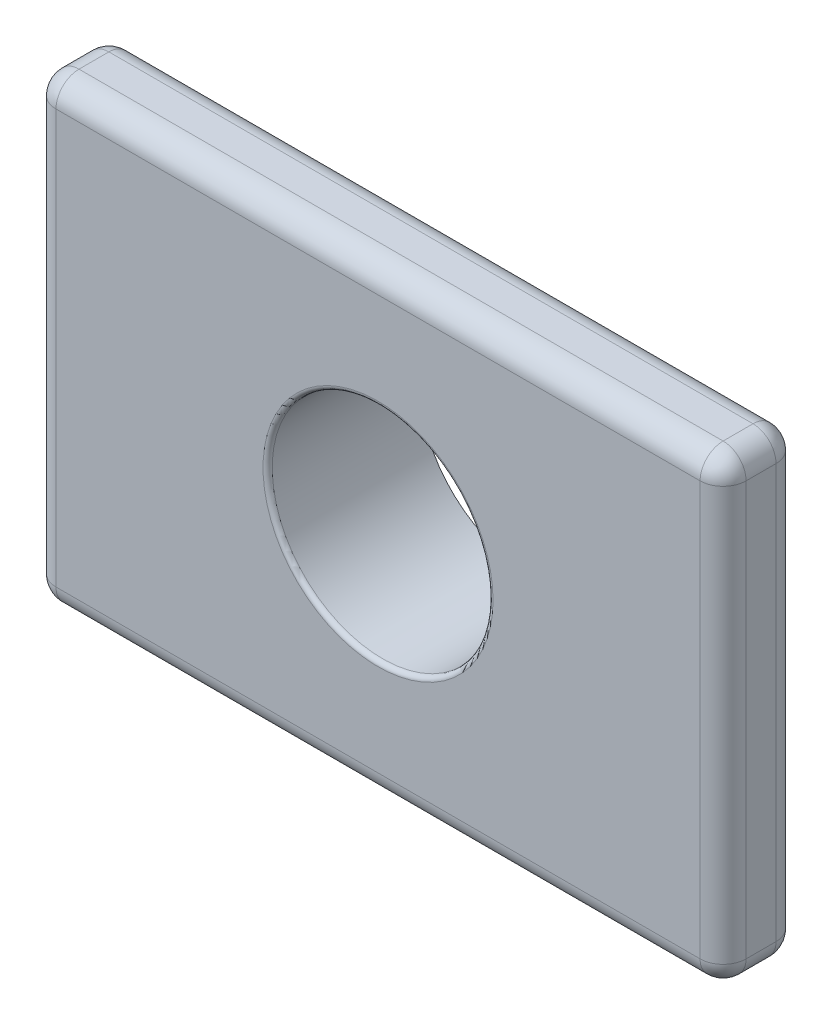
ISO-10303-21;
HEADER;
FILE_DESCRIPTION(('STEP AP214'),'2;1');
FILE_NAME('part.step','',(''),(''),'','','');
FILE_SCHEMA(('AUTOMOTIVE_DESIGN { 1 0 10303 214 1 1 1 1 }'));
ENDSEC;
DATA;
#1=APPLICATION_CONTEXT('core data for automotive mechanical design processes');
#2=APPLICATION_PROTOCOL_DEFINITION('international standard','automotive_design',2000,#1);
#3=PRODUCT_CONTEXT('',#1,'mechanical');
#4=PRODUCT('Part','Part','',(#3));
#5=PRODUCT_RELATED_PRODUCT_CATEGORY('part','',(#4));
#6=PRODUCT_DEFINITION_FORMATION('','',#4);
#7=PRODUCT_DEFINITION_CONTEXT('part definition',#1,'design');
#8=PRODUCT_DEFINITION('design','',#6,#7);
#9=PRODUCT_DEFINITION_SHAPE('','',#8);
#10=(LENGTH_UNIT() NAMED_UNIT(*) SI_UNIT(.MILLI.,.METRE.));
#11=(NAMED_UNIT(*) PLANE_ANGLE_UNIT() SI_UNIT($,.RADIAN.));
#12=(NAMED_UNIT(*) SI_UNIT($,.STERADIAN.) SOLID_ANGLE_UNIT());
#13=UNCERTAINTY_MEASURE_WITH_UNIT(LENGTH_MEASURE(1.E-05),#10,'distance_accuracy_value','');
#14=(GEOMETRIC_REPRESENTATION_CONTEXT(3) GLOBAL_UNCERTAINTY_ASSIGNED_CONTEXT((#13)) GLOBAL_UNIT_ASSIGNED_CONTEXT((#10,
#11,#12)) REPRESENTATION_CONTEXT('',''));
#15=CARTESIAN_POINT('',(0.,0.,0.));
#16=DIRECTION('',(0.,0.,1.));
#17=DIRECTION('',(1.,0.,0.));
#18=AXIS2_PLACEMENT_3D('',#15,#16,#17);
#19=CARTESIAN_POINT('',(0.,0.,0.));
#20=DIRECTION('',(0.,0.,1.));
#21=DIRECTION('',(1.,0.,0.));
#22=AXIS2_PLACEMENT_3D('',#19,#20,#21);
#23=PLANE('',#22);
#24=DIRECTION('',(0.,1.,0.));
#25=VECTOR('',#24,1.);
#26=CARTESIAN_POINT('',(14.5,0.,0.));
#27=LINE('',#26,#25);
#28=CARTESIAN_POINT('',(14.5,9.498,0.));
#29=VERTEX_POINT('',#28);
#30=CARTESIAN_POINT('',(14.5,0.5,0.));
#31=VERTEX_POINT('',#30);
#32=EDGE_CURVE('E313',#29,#31,#27,.F.);
#33=ORIENTED_EDGE('',*,*,#32,.T.);
#34=DIRECTION('',(1.,0.,0.));
#35=VECTOR('',#34,1.);
#36=CARTESIAN_POINT('',(0.,0.5,0.));
#37=LINE('',#36,#35);
#38=CARTESIAN_POINT('',(0.5,0.5,0.));
#39=VERTEX_POINT('',#38);
#40=EDGE_CURVE('E170',#31,#39,#37,.F.);
#41=ORIENTED_EDGE('',*,*,#40,.T.);
#42=DIRECTION('',(0.,1.,0.));
#43=VECTOR('',#42,1.);
#44=CARTESIAN_POINT('',(0.5,9.498,0.));
#45=LINE('',#44,#43);
#46=CARTESIAN_POINT('',(0.5,9.498,0.));
#47=VERTEX_POINT('',#46);
#48=EDGE_CURVE('E64',#39,#47,#45,.T.);
#49=ORIENTED_EDGE('',*,*,#48,.T.);
#50=DIRECTION('',(1.,0.,0.));
#51=VECTOR('',#50,1.);
#52=CARTESIAN_POINT('',(14.5,9.498,0.));
#53=LINE('',#52,#51);
#54=EDGE_CURVE('E316',#47,#29,#53,.T.);
#55=ORIENTED_EDGE('',*,*,#54,.T.);
#56=EDGE_LOOP('',(#33,#41,#49,#55));
#57=FACE_BOUND('',#56,.T.);
#58=CARTESIAN_POINT('',(7.5,4.999,0.));
#59=DIRECTION('',(0.,0.,1.));
#60=DIRECTION('',(1.,0.,0.));
#61=AXIS2_PLACEMENT_3D('',#58,#59,#60);
#62=CIRCLE('',#61,2.7);
#63=CARTESIAN_POINT('',(10.2,4.999,0.));
#64=VERTEX_POINT('',#63);
#65=EDGE_CURVE('E257',#64,#64,#62,.T.);
#66=ORIENTED_EDGE('',*,*,#65,.T.);
#67=EDGE_LOOP('',(#66));
#68=FACE_BOUND('',#67,.T.);
#69=ADVANCED_FACE('F38',(#57,#68),#23,.F.);
#70=CARTESIAN_POINT('',(0.,0.,1.65));
#71=DIRECTION('',(0.,1.,0.));
#72=DIRECTION('',(0.,0.,1.));
#73=AXIS2_PLACEMENT_3D('',#70,#71,#72);
#74=PLANE('',#73);
#75=DIRECTION('',(0.,0.,-1.));
#76=VECTOR('',#75,1.);
#77=CARTESIAN_POINT('',(14.5,0.,1.65));
#78=LINE('',#77,#76);
#79=CARTESIAN_POINT('',(14.5,0.,0.5));
#80=VERTEX_POINT('',#79);
#81=CARTESIAN_POINT('',(14.5,0.,1.15));
#82=VERTEX_POINT('',#81);
#83=EDGE_CURVE('E141',#80,#82,#78,.F.);
#84=ORIENTED_EDGE('',*,*,#83,.T.);
#85=DIRECTION('',(1.,0.,0.));
#86=VECTOR('',#85,1.);
#87=CARTESIAN_POINT('',(0.5,0.,1.15));
#88=LINE('',#87,#86);
#89=CARTESIAN_POINT('',(0.5,0.,1.15));
#90=VERTEX_POINT('',#89);
#91=EDGE_CURVE('E145',#82,#90,#88,.F.);
#92=ORIENTED_EDGE('',*,*,#91,.T.);
#93=DIRECTION('',(0.,0.,-1.));
#94=VECTOR('',#93,1.);
#95=CARTESIAN_POINT('',(0.5,0.,0.));
#96=LINE('',#95,#94);
#97=CARTESIAN_POINT('',(0.5,0.,0.5));
#98=VERTEX_POINT('',#97);
#99=EDGE_CURVE('E143',#90,#98,#96,.T.);
#100=ORIENTED_EDGE('',*,*,#99,.T.);
#101=DIRECTION('',(1.,0.,0.));
#102=VECTOR('',#101,1.);
#103=CARTESIAN_POINT('',(0.,0.,0.5));
#104=LINE('',#103,#102);
#105=EDGE_CURVE('E138',#98,#80,#104,.T.);
#106=ORIENTED_EDGE('',*,*,#105,.T.);
#107=EDGE_LOOP('',(#84,#92,#100,#106));
#108=FACE_BOUND('',#107,.T.);
#109=ADVANCED_FACE('F140',(#108),#74,.F.);
#110=CARTESIAN_POINT('',(15.,0.,1.65));
#111=DIRECTION('',(-1.,0.,0.));
#112=DIRECTION('',(0.,0.,1.));
#113=AXIS2_PLACEMENT_3D('',#110,#111,#112);
#114=PLANE('',#113);
#115=DIRECTION('',(0.,0.,-1.));
#116=VECTOR('',#115,1.);
#117=CARTESIAN_POINT('',(15.,9.498,1.65));
#118=LINE('',#117,#116);
#119=CARTESIAN_POINT('',(15.,9.498,0.5));
#120=VERTEX_POINT('',#119);
#121=CARTESIAN_POINT('',(15.,9.498,1.15));
#122=VERTEX_POINT('',#121);
#123=EDGE_CURVE('E270',#120,#122,#118,.F.);
#124=ORIENTED_EDGE('',*,*,#123,.T.);
#125=DIRECTION('',(0.,1.,0.));
#126=VECTOR('',#125,1.);
#127=CARTESIAN_POINT('',(15.,0.5,1.15));
#128=LINE('',#127,#126);
#129=CARTESIAN_POINT('',(15.,0.5,1.15));
#130=VERTEX_POINT('',#129);
#131=EDGE_CURVE('E11',#122,#130,#128,.F.);
#132=ORIENTED_EDGE('',*,*,#131,.T.);
#133=DIRECTION('',(0.,0.,-1.));
#134=VECTOR('',#133,1.);
#135=CARTESIAN_POINT('',(15.,0.5,1.65));
#136=LINE('',#135,#134);
#137=CARTESIAN_POINT('',(15.,0.5,0.5));
#138=VERTEX_POINT('',#137);
#139=EDGE_CURVE('E268',#130,#138,#136,.T.);
#140=ORIENTED_EDGE('',*,*,#139,.T.);
#141=DIRECTION('',(0.,1.,0.));
#142=VECTOR('',#141,1.);
#143=CARTESIAN_POINT('',(15.,0.,0.5));
#144=LINE('',#143,#142);
#145=EDGE_CURVE('E48',#138,#120,#144,.T.);
#146=ORIENTED_EDGE('',*,*,#145,.T.);
#147=EDGE_LOOP('',(#124,#132,#140,#146));
#148=FACE_BOUND('',#147,.T.);
#149=ADVANCED_FACE('F322',(#148),#114,.F.);
#150=CARTESIAN_POINT('',(0.,9.998,1.65));
#151=DIRECTION('',(0.,1.,0.));
#152=DIRECTION('',(0.,0.,1.));
#153=AXIS2_PLACEMENT_3D('',#150,#151,#152);
#154=PLANE('',#153);
#155=DIRECTION('',(0.,0.,-1.));
#156=VECTOR('',#155,1.);
#157=CARTESIAN_POINT('',(0.5,9.998,1.65));
#158=LINE('',#157,#156);
#159=CARTESIAN_POINT('',(0.5,9.998,0.5));
#160=VERTEX_POINT('',#159);
#161=CARTESIAN_POINT('',(0.5,9.998,1.15));
#162=VERTEX_POINT('',#161);
#163=EDGE_CURVE('E261',#160,#162,#158,.F.);
#164=ORIENTED_EDGE('',*,*,#163,.T.);
#165=DIRECTION('',(1.,0.,0.));
#166=VECTOR('',#165,1.);
#167=CARTESIAN_POINT('',(0.,9.998,1.15));
#168=LINE('',#167,#166);
#169=CARTESIAN_POINT('',(14.5,9.998,1.15));
#170=VERTEX_POINT('',#169);
#171=EDGE_CURVE('E304',#162,#170,#168,.T.);
#172=ORIENTED_EDGE('',*,*,#171,.T.);
#173=DIRECTION('',(0.,0.,-1.));
#174=VECTOR('',#173,1.);
#175=CARTESIAN_POINT('',(14.5,9.998,0.));
#176=LINE('',#175,#174);
#177=CARTESIAN_POINT('',(14.5,9.998,0.5));
#178=VERTEX_POINT('',#177);
#179=EDGE_CURVE('E264',#170,#178,#176,.T.);
#180=ORIENTED_EDGE('',*,*,#179,.T.);
#181=DIRECTION('',(1.,0.,0.));
#182=VECTOR('',#181,1.);
#183=CARTESIAN_POINT('',(0.5,9.998,0.5));
#184=LINE('',#183,#182);
#185=EDGE_CURVE('E301',#178,#160,#184,.F.);
#186=ORIENTED_EDGE('',*,*,#185,.T.);
#187=EDGE_LOOP('',(#164,#172,#180,#186));
#188=FACE_BOUND('',#187,.T.);
#189=ADVANCED_FACE('F340',(#188),#154,.T.);
#190=CARTESIAN_POINT('',(0.,0.,1.65));
#191=DIRECTION('',(-1.,0.,0.));
#192=DIRECTION('',(0.,0.,1.));
#193=AXIS2_PLACEMENT_3D('',#190,#191,#192);
#194=PLANE('',#193);
#195=DIRECTION('',(0.,0.,-1.));
#196=VECTOR('',#195,1.);
#197=CARTESIAN_POINT('',(0.,0.5,1.65));
#198=LINE('',#197,#196);
#199=CARTESIAN_POINT('',(0.,0.5,0.5));
#200=VERTEX_POINT('',#199);
#201=CARTESIAN_POINT('',(0.,0.5,1.15));
#202=VERTEX_POINT('',#201);
#203=EDGE_CURVE('E158',#200,#202,#198,.F.);
#204=ORIENTED_EDGE('',*,*,#203,.T.);
#205=DIRECTION('',(0.,1.,0.));
#206=VECTOR('',#205,1.);
#207=CARTESIAN_POINT('',(0.,0.,1.15));
#208=LINE('',#207,#206);
#209=CARTESIAN_POINT('',(0.,9.498,1.15));
#210=VERTEX_POINT('',#209);
#211=EDGE_CURVE('E295',#202,#210,#208,.T.);
#212=ORIENTED_EDGE('',*,*,#211,.T.);
#213=DIRECTION('',(0.,0.,-1.));
#214=VECTOR('',#213,1.);
#215=CARTESIAN_POINT('',(0.,9.498,1.65));
#216=LINE('',#215,#214);
#217=CARTESIAN_POINT('',(0.,9.498,0.5));
#218=VERTEX_POINT('',#217);
#219=EDGE_CURVE('E167',#210,#218,#216,.T.);
#220=ORIENTED_EDGE('',*,*,#219,.T.);
#221=DIRECTION('',(0.,1.,0.));
#222=VECTOR('',#221,1.);
#223=CARTESIAN_POINT('',(0.,0.5,0.5));
#224=LINE('',#223,#222);
#225=EDGE_CURVE('E293',#218,#200,#224,.F.);
#226=ORIENTED_EDGE('',*,*,#225,.T.);
#227=EDGE_LOOP('',(#204,#212,#220,#226));
#228=FACE_BOUND('',#227,.T.);
#229=ADVANCED_FACE('F352',(#228),#194,.T.);
#230=CARTESIAN_POINT('',(0.,0.,1.65));
#231=DIRECTION('',(0.,0.,1.));
#232=DIRECTION('',(1.,0.,0.));
#233=AXIS2_PLACEMENT_3D('',#230,#231,#232);
#234=PLANE('',#233);
#235=DIRECTION('',(0.,1.,0.));
#236=VECTOR('',#235,1.);
#237=CARTESIAN_POINT('',(0.5,0.,1.65));
#238=LINE('',#237,#236);
#239=CARTESIAN_POINT('',(0.5,9.498,1.65));
#240=VERTEX_POINT('',#239);
#241=CARTESIAN_POINT('',(0.5,0.5,1.65));
#242=VERTEX_POINT('',#241);
#243=EDGE_CURVE('E284',#240,#242,#238,.F.);
#244=ORIENTED_EDGE('',*,*,#243,.T.);
#245=DIRECTION('',(1.,0.,0.));
#246=VECTOR('',#245,1.);
#247=CARTESIAN_POINT('',(14.5,0.5,1.65));
#248=LINE('',#247,#246);
#249=CARTESIAN_POINT('',(14.5,0.5,1.65));
#250=VERTEX_POINT('',#249);
#251=EDGE_CURVE('E146',#242,#250,#248,.T.);
#252=ORIENTED_EDGE('',*,*,#251,.T.);
#253=DIRECTION('',(0.,1.,0.));
#254=VECTOR('',#253,1.);
#255=CARTESIAN_POINT('',(14.5,9.498,1.65));
#256=LINE('',#255,#254);
#257=CARTESIAN_POINT('',(14.5,9.498,1.65));
#258=VERTEX_POINT('',#257);
#259=EDGE_CURVE('E279',#250,#258,#256,.T.);
#260=ORIENTED_EDGE('',*,*,#259,.T.);
#261=DIRECTION('',(1.,0.,0.));
#262=VECTOR('',#261,1.);
#263=CARTESIAN_POINT('',(0.,9.498,1.65));
#264=LINE('',#263,#262);
#265=EDGE_CURVE('E282',#258,#240,#264,.F.);
#266=ORIENTED_EDGE('',*,*,#265,.T.);
#267=EDGE_LOOP('',(#244,#252,#260,#266));
#268=FACE_BOUND('',#267,.T.);
#269=CARTESIAN_POINT('',(7.5,4.999,1.65));
#270=DIRECTION('',(0.,0.,1.));
#271=DIRECTION('',(1.,0.,0.));
#272=AXIS2_PLACEMENT_3D('',#269,#270,#271);
#273=CIRCLE('',#272,2.5);
#274=CARTESIAN_POINT('',(10.,4.999,1.65));
#275=VERTEX_POINT('',#274);
#276=EDGE_CURVE('E241',#275,#275,#273,.F.);
#277=ORIENTED_EDGE('',*,*,#276,.T.);
#278=EDGE_LOOP('',(#277));
#279=FACE_BOUND('',#278,.T.);
#280=ADVANCED_FACE('F366',(#268,#279),#234,.T.);
#281=CARTESIAN_POINT('',(7.5,4.999,-1.65));
#282=DIRECTION('',(0.,0.,1.));
#283=DIRECTION('',(1.,0.,0.));
#284=AXIS2_PLACEMENT_3D('',#281,#282,#283);
#285=CYLINDRICAL_SURFACE('',#284,2.6);
#286=CARTESIAN_POINT('',(7.5,4.999,-1.55));
#287=DIRECTION('',(0.,0.,-1.));
#288=DIRECTION('',(-1.,0.,0.));
#289=AXIS2_PLACEMENT_3D('',#286,#287,#288);
#290=CIRCLE('',#289,2.6);
#291=CARTESIAN_POINT('',(4.9,4.999,-1.55));
#292=VERTEX_POINT('',#291);
#293=EDGE_CURVE('E254',#292,#292,#290,.F.);
#294=ORIENTED_EDGE('',*,*,#293,.T.);
#295=EDGE_LOOP('',(#294));
#296=FACE_BOUND('',#295,.T.);
#297=CARTESIAN_POINT('',(7.5,4.999,-0.1));
#298=DIRECTION('',(0.,0.,1.));
#299=DIRECTION('',(1.,0.,0.));
#300=AXIS2_PLACEMENT_3D('',#297,#298,#299);
#301=CIRCLE('',#300,2.6);
#302=CARTESIAN_POINT('',(10.1,4.999,-0.1));
#303=VERTEX_POINT('',#302);
#304=EDGE_CURVE('E250',#303,#303,#301,.F.);
#305=ORIENTED_EDGE('',*,*,#304,.T.);
#306=EDGE_LOOP('',(#305));
#307=FACE_BOUND('',#306,.T.);
#308=ADVANCED_FACE('F604',(#296,#307),#285,.T.);
#309=CARTESIAN_POINT('',(7.5,4.999,-1.65));
#310=DIRECTION('',(0.,0.,-1.));
#311=DIRECTION('',(-1.,0.,0.));
#312=AXIS2_PLACEMENT_3D('',#309,#310,#311);
#313=PLANE('',#312);
#314=CARTESIAN_POINT('',(7.5,4.999,-1.65));
#315=DIRECTION('',(0.,0.,-1.));
#316=DIRECTION('',(-1.,0.,0.));
#317=AXIS2_PLACEMENT_3D('',#314,#315,#316);
#318=CIRCLE('',#317,2.5);
#319=CARTESIAN_POINT('',(5.,4.999,-1.65));
#320=VERTEX_POINT('',#319);
#321=EDGE_CURVE('E247',#320,#320,#318,.T.);
#322=ORIENTED_EDGE('',*,*,#321,.T.);
#323=EDGE_LOOP('',(#322));
#324=FACE_BOUND('',#323,.T.);
#325=CARTESIAN_POINT('',(7.5,4.999,-1.65));
#326=DIRECTION('',(0.,0.,1.));
#327=DIRECTION('',(1.,0.,0.));
#328=AXIS2_PLACEMENT_3D('',#325,#326,#327);
#329=CIRCLE('',#328,2.4);
#330=CARTESIAN_POINT('',(9.9,4.999,-1.65));
#331=VERTEX_POINT('',#330);
#332=EDGE_CURVE('E229',#331,#331,#329,.T.);
#333=ORIENTED_EDGE('',*,*,#332,.T.);
#334=EDGE_LOOP('',(#333));
#335=FACE_BOUND('',#334,.T.);
#336=ADVANCED_FACE('F595',(#324,#335),#313,.T.);
#337=CARTESIAN_POINT('',(7.5,4.999,-1.65));
#338=DIRECTION('',(0.,0.,1.));
#339=DIRECTION('',(1.,0.,0.));
#340=AXIS2_PLACEMENT_3D('',#337,#338,#339);
#341=CYLINDRICAL_SURFACE('',#340,2.4);
#342=CARTESIAN_POINT('',(7.5,4.999,1.55));
#343=DIRECTION('',(0.,0.,1.));
#344=DIRECTION('',(1.,0.,0.));
#345=AXIS2_PLACEMENT_3D('',#342,#343,#344);
#346=CIRCLE('',#345,2.4);
#347=CARTESIAN_POINT('',(9.9,4.999,1.55));
#348=VERTEX_POINT('',#347);
#349=EDGE_CURVE('E235',#348,#348,#346,.T.);
#350=ORIENTED_EDGE('',*,*,#349,.T.);
#351=EDGE_LOOP('',(#350));
#352=FACE_BOUND('',#351,.T.);
#353=ORIENTED_EDGE('',*,*,#332,.F.);
#354=EDGE_LOOP('',(#353));
#355=FACE_BOUND('',#354,.T.);
#356=ADVANCED_FACE('F406',(#352,#355),#341,.F.);
#357=CARTESIAN_POINT('',(7.5,4.999,1.55));
#358=DIRECTION('',(0.,0.,1.));
#359=DIRECTION('',(1.,0.,0.));
#360=AXIS2_PLACEMENT_3D('',#357,#358,#359);
#361=TOROIDAL_SURFACE('',#360,2.5,0.1);
#362=ORIENTED_EDGE('',*,*,#276,.F.);
#363=EDGE_LOOP('',(#362));
#364=FACE_BOUND('',#363,.T.);
#365=ORIENTED_EDGE('',*,*,#349,.F.);
#366=EDGE_LOOP('',(#365));
#367=FACE_BOUND('',#366,.T.);
#368=ADVANCED_FACE('F402',(#364,#367),#361,.T.);
#369=CARTESIAN_POINT('',(7.5,4.999,-1.55));
#370=DIRECTION('',(0.,0.,-1.));
#371=DIRECTION('',(-1.,0.,0.));
#372=AXIS2_PLACEMENT_3D('',#369,#370,#371);
#373=TOROIDAL_SURFACE('',#372,2.5,0.1);
#374=ORIENTED_EDGE('',*,*,#293,.F.);
#375=EDGE_LOOP('',(#374));
#376=FACE_BOUND('',#375,.T.);
#377=ORIENTED_EDGE('',*,*,#321,.F.);
#378=EDGE_LOOP('',(#377));
#379=FACE_BOUND('',#378,.T.);
#380=ADVANCED_FACE('F405',(#376,#379),#373,.T.);
#381=CARTESIAN_POINT('',(7.5,4.999,-0.1));
#382=DIRECTION('',(0.,0.,1.));
#383=DIRECTION('',(1.,0.,0.));
#384=AXIS2_PLACEMENT_3D('',#381,#382,#383);
#385=TOROIDAL_SURFACE('',#384,2.7,0.1);
#386=ORIENTED_EDGE('',*,*,#65,.F.);
#387=EDGE_LOOP('',(#386));
#388=FACE_BOUND('',#387,.T.);
#389=ORIENTED_EDGE('',*,*,#304,.F.);
#390=EDGE_LOOP('',(#389));
#391=FACE_BOUND('',#390,.T.);
#392=ADVANCED_FACE('F410',(#388,#391),#385,.F.);
#393=CARTESIAN_POINT('',(14.5,9.498,1.65));
#394=DIRECTION('',(0.,0.,1.));
#395=DIRECTION('',(1.,0.,0.));
#396=AXIS2_PLACEMENT_3D('',#393,#394,#395);
#397=CYLINDRICAL_SURFACE('',#396,0.5);
#398=ORIENTED_EDGE('',*,*,#179,.F.);
#399=CARTESIAN_POINT('',(14.5,9.498,1.15));
#400=DIRECTION('',(0.,0.,1.));
#401=DIRECTION('',(1.,0.,0.));
#402=AXIS2_PLACEMENT_3D('',#399,#400,#401);
#403=CIRCLE('',#402,0.5);
#404=EDGE_CURVE('E310',#170,#122,#403,.F.);
#405=ORIENTED_EDGE('',*,*,#404,.T.);
#406=ORIENTED_EDGE('',*,*,#123,.F.);
#407=CARTESIAN_POINT('',(14.5,9.498,0.5));
#408=DIRECTION('',(0.,0.,1.));
#409=DIRECTION('',(1.,0.,0.));
#410=AXIS2_PLACEMENT_3D('',#407,#408,#409);
#411=CIRCLE('',#410,0.5);
#412=EDGE_CURVE('E307',#120,#178,#411,.T.);
#413=ORIENTED_EDGE('',*,*,#412,.T.);
#414=EDGE_LOOP('',(#398,#405,#406,#413));
#415=FACE_BOUND('',#414,.T.);
#416=ADVANCED_FACE('F328',(#415),#397,.T.);
#417=CARTESIAN_POINT('',(14.5,0.5,1.65));
#418=DIRECTION('',(0.,0.,-1.));
#419=DIRECTION('',(-1.,0.,0.));
#420=AXIS2_PLACEMENT_3D('',#417,#418,#419);
#421=CYLINDRICAL_SURFACE('',#420,0.5);
#422=ORIENTED_EDGE('',*,*,#139,.F.);
#423=CARTESIAN_POINT('',(14.5,0.5,1.15));
#424=DIRECTION('',(0.,0.,-1.));
#425=DIRECTION('',(-1.,0.,0.));
#426=AXIS2_PLACEMENT_3D('',#423,#424,#425);
#427=CIRCLE('',#426,0.5);
#428=EDGE_CURVE('E157',#130,#82,#427,.T.);
#429=ORIENTED_EDGE('',*,*,#428,.T.);
#430=ORIENTED_EDGE('',*,*,#83,.F.);
#431=CARTESIAN_POINT('',(14.5,0.5,0.5));
#432=DIRECTION('',(0.,0.,-1.));
#433=DIRECTION('',(-1.,0.,0.));
#434=AXIS2_PLACEMENT_3D('',#431,#432,#433);
#435=CIRCLE('',#434,0.5);
#436=EDGE_CURVE('E154',#80,#138,#435,.F.);
#437=ORIENTED_EDGE('',*,*,#436,.T.);
#438=EDGE_LOOP('',(#422,#429,#430,#437));
#439=FACE_BOUND('',#438,.T.);
#440=ADVANCED_FACE('F153',(#439),#421,.T.);
#441=CARTESIAN_POINT('',(0.5,9.498,1.65));
#442=DIRECTION('',(0.,0.,-1.));
#443=DIRECTION('',(-1.,0.,0.));
#444=AXIS2_PLACEMENT_3D('',#441,#442,#443);
#445=CYLINDRICAL_SURFACE('',#444,0.5);
#446=ORIENTED_EDGE('',*,*,#219,.F.);
#447=CARTESIAN_POINT('',(0.5,9.498,1.15));
#448=DIRECTION('',(0.,0.,-1.));
#449=DIRECTION('',(-1.,0.,0.));
#450=AXIS2_PLACEMENT_3D('',#447,#448,#449);
#451=CIRCLE('',#450,0.5);
#452=EDGE_CURVE('E299',#210,#162,#451,.T.);
#453=ORIENTED_EDGE('',*,*,#452,.T.);
#454=ORIENTED_EDGE('',*,*,#163,.F.);
#455=CARTESIAN_POINT('',(0.5,9.498,0.5));
#456=DIRECTION('',(0.,0.,-1.));
#457=DIRECTION('',(-1.,0.,0.));
#458=AXIS2_PLACEMENT_3D('',#455,#456,#457);
#459=CIRCLE('',#458,0.5);
#460=EDGE_CURVE('E297',#160,#218,#459,.F.);
#461=ORIENTED_EDGE('',*,*,#460,.T.);
#462=EDGE_LOOP('',(#446,#453,#454,#461));
#463=FACE_BOUND('',#462,.T.);
#464=ADVANCED_FACE('F344',(#463),#445,.T.);
#465=CARTESIAN_POINT('',(0.5,0.5,1.65));
#466=DIRECTION('',(0.,0.,1.));
#467=DIRECTION('',(1.,0.,0.));
#468=AXIS2_PLACEMENT_3D('',#465,#466,#467);
#469=CYLINDRICAL_SURFACE('',#468,0.5);
#470=ORIENTED_EDGE('',*,*,#99,.F.);
#471=CARTESIAN_POINT('',(0.5,0.5,1.15));
#472=DIRECTION('',(0.,0.,1.));
#473=DIRECTION('',(1.,0.,0.));
#474=AXIS2_PLACEMENT_3D('',#471,#472,#473);
#475=CIRCLE('',#474,0.5);
#476=EDGE_CURVE('E291',#90,#202,#475,.F.);
#477=ORIENTED_EDGE('',*,*,#476,.T.);
#478=ORIENTED_EDGE('',*,*,#203,.F.);
#479=CARTESIAN_POINT('',(0.5,0.5,0.5));
#480=DIRECTION('',(0.,0.,1.));
#481=DIRECTION('',(1.,0.,0.));
#482=AXIS2_PLACEMENT_3D('',#479,#480,#481);
#483=CIRCLE('',#482,0.5);
#484=EDGE_CURVE('E289',#200,#98,#483,.T.);
#485=ORIENTED_EDGE('',*,*,#484,.T.);
#486=EDGE_LOOP('',(#470,#477,#478,#485));
#487=FACE_BOUND('',#486,.T.);
#488=ADVANCED_FACE('F354',(#487),#469,.T.);
#489=CARTESIAN_POINT('',(0.5,9.498,1.15));
#490=DIRECTION('',(0.,0.,1.));
#491=DIRECTION('',(1.,0.,0.));
#492=AXIS2_PLACEMENT_3D('',#489,#490,#491);
#493=SPHERICAL_SURFACE('',#492,0.5);
#494=CARTESIAN_POINT('',(0.5,9.498,1.15));
#495=DIRECTION('',(1.,0.,0.));
#496=DIRECTION('',(0.,0.,-1.));
#497=AXIS2_PLACEMENT_3D('',#494,#495,#496);
#498=CIRCLE('',#497,0.5);
#499=EDGE_CURVE('E218',#162,#240,#498,.T.);
#500=ORIENTED_EDGE('',*,*,#499,.F.);
#501=ORIENTED_EDGE('',*,*,#452,.F.);
#502=CARTESIAN_POINT('',(0.5,9.498,1.15));
#503=DIRECTION('',(0.,-1.,0.));
#504=DIRECTION('',(0.,0.,-1.));
#505=AXIS2_PLACEMENT_3D('',#502,#503,#504);
#506=CIRCLE('',#505,0.5);
#507=EDGE_CURVE('E174',#240,#210,#506,.T.);
#508=ORIENTED_EDGE('',*,*,#507,.F.);
#509=EDGE_LOOP('',(#500,#501,#508));
#510=FACE_BOUND('',#509,.T.);
#511=ADVANCED_FACE('F370',(#510),#493,.T.);
#512=CARTESIAN_POINT('',(0.5,0.,1.15));
#513=DIRECTION('',(0.,1.,0.));
#514=DIRECTION('',(0.,0.,1.));
#515=AXIS2_PLACEMENT_3D('',#512,#513,#514);
#516=CYLINDRICAL_SURFACE('',#515,0.5);
#517=ORIENTED_EDGE('',*,*,#507,.T.);
#518=ORIENTED_EDGE('',*,*,#211,.F.);
#519=CARTESIAN_POINT('',(0.5,0.5,1.15));
#520=DIRECTION('',(0.,-1.,0.));
#521=DIRECTION('',(0.,0.,-1.));
#522=AXIS2_PLACEMENT_3D('',#519,#520,#521);
#523=CIRCLE('',#522,0.5);
#524=EDGE_CURVE('E216',#242,#202,#523,.T.);
#525=ORIENTED_EDGE('',*,*,#524,.F.);
#526=ORIENTED_EDGE('',*,*,#243,.F.);
#527=EDGE_LOOP('',(#517,#518,#525,#526));
#528=FACE_BOUND('',#527,.T.);
#529=ADVANCED_FACE('F368',(#528),#516,.T.);
#530=CARTESIAN_POINT('',(0.,9.498,1.15));
#531=DIRECTION('',(1.,0.,0.));
#532=DIRECTION('',(0.,0.,-1.));
#533=AXIS2_PLACEMENT_3D('',#530,#531,#532);
#534=CYLINDRICAL_SURFACE('',#533,0.5);
#535=ORIENTED_EDGE('',*,*,#499,.T.);
#536=ORIENTED_EDGE('',*,*,#265,.F.);
#537=CARTESIAN_POINT('',(14.5,9.498,1.15));
#538=DIRECTION('',(1.,0.,0.));
#539=DIRECTION('',(0.,0.,-1.));
#540=AXIS2_PLACEMENT_3D('',#537,#538,#539);
#541=CIRCLE('',#540,0.5);
#542=EDGE_CURVE('E212',#170,#258,#541,.T.);
#543=ORIENTED_EDGE('',*,*,#542,.F.);
#544=ORIENTED_EDGE('',*,*,#171,.F.);
#545=EDGE_LOOP('',(#535,#536,#543,#544));
#546=FACE_BOUND('',#545,.T.);
#547=ADVANCED_FACE('F372',(#546),#534,.T.);
#548=CARTESIAN_POINT('',(0.5,0.5,1.15));
#549=DIRECTION('',(0.,0.,1.));
#550=DIRECTION('',(1.,0.,0.));
#551=AXIS2_PLACEMENT_3D('',#548,#549,#550);
#552=SPHERICAL_SURFACE('',#551,0.5);
#553=ORIENTED_EDGE('',*,*,#524,.T.);
#554=ORIENTED_EDGE('',*,*,#476,.F.);
#555=CARTESIAN_POINT('',(0.5,0.5,1.15));
#556=DIRECTION('',(1.,0.,0.));
#557=DIRECTION('',(0.,0.,-1.));
#558=AXIS2_PLACEMENT_3D('',#555,#556,#557);
#559=CIRCLE('',#558,0.5);
#560=EDGE_CURVE('E209',#242,#90,#559,.T.);
#561=ORIENTED_EDGE('',*,*,#560,.F.);
#562=EDGE_LOOP('',(#553,#554,#561));
#563=FACE_BOUND('',#562,.T.);
#564=ADVANCED_FACE('F358',(#563),#552,.T.);
#565=CARTESIAN_POINT('',(14.5,9.498,1.15));
#566=DIRECTION('',(0.,0.,1.));
#567=DIRECTION('',(1.,0.,0.));
#568=AXIS2_PLACEMENT_3D('',#565,#566,#567);
#569=SPHERICAL_SURFACE('',#568,0.5);
#570=ORIENTED_EDGE('',*,*,#404,.F.);
#571=ORIENTED_EDGE('',*,*,#542,.T.);
#572=CARTESIAN_POINT('',(14.5,9.498,1.15));
#573=DIRECTION('',(0.,-1.,0.));
#574=DIRECTION('',(0.,0.,-1.));
#575=AXIS2_PLACEMENT_3D('',#572,#573,#574);
#576=CIRCLE('',#575,0.5);
#577=EDGE_CURVE('E202',#122,#258,#576,.T.);
#578=ORIENTED_EDGE('',*,*,#577,.F.);
#579=EDGE_LOOP('',(#570,#571,#578));
#580=FACE_BOUND('',#579,.T.);
#581=ADVANCED_FACE('F374',(#580),#569,.T.);
#582=CARTESIAN_POINT('',(0.,0.5,1.15));
#583=DIRECTION('',(-1.,0.,0.));
#584=DIRECTION('',(0.,0.,1.));
#585=AXIS2_PLACEMENT_3D('',#582,#583,#584);
#586=CYLINDRICAL_SURFACE('',#585,0.5);
#587=ORIENTED_EDGE('',*,*,#560,.T.);
#588=ORIENTED_EDGE('',*,*,#91,.F.);
#589=CARTESIAN_POINT('',(14.5,0.5,1.15));
#590=DIRECTION('',(1.,0.,0.));
#591=DIRECTION('',(0.,0.,-1.));
#592=AXIS2_PLACEMENT_3D('',#589,#590,#591);
#593=CIRCLE('',#592,0.5);
#594=EDGE_CURVE('E197',#250,#82,#593,.T.);
#595=ORIENTED_EDGE('',*,*,#594,.F.);
#596=ORIENTED_EDGE('',*,*,#251,.F.);
#597=EDGE_LOOP('',(#587,#588,#595,#596));
#598=FACE_BOUND('',#597,.T.);
#599=ADVANCED_FACE('F363',(#598),#586,.T.);
#600=CARTESIAN_POINT('',(14.5,0.,1.15));
#601=DIRECTION('',(0.,-1.,0.));
#602=DIRECTION('',(0.,0.,-1.));
#603=AXIS2_PLACEMENT_3D('',#600,#601,#602);
#604=CYLINDRICAL_SURFACE('',#603,0.5);
#605=ORIENTED_EDGE('',*,*,#577,.T.);
#606=ORIENTED_EDGE('',*,*,#259,.F.);
#607=CARTESIAN_POINT('',(14.5,0.5,1.15));
#608=DIRECTION('',(0.,-1.,0.));
#609=DIRECTION('',(0.,0.,-1.));
#610=AXIS2_PLACEMENT_3D('',#607,#608,#609);
#611=CIRCLE('',#610,0.5);
#612=EDGE_CURVE('E193',#130,#250,#611,.T.);
#613=ORIENTED_EDGE('',*,*,#612,.F.);
#614=ORIENTED_EDGE('',*,*,#131,.F.);
#615=EDGE_LOOP('',(#605,#606,#613,#614));
#616=FACE_BOUND('',#615,.T.);
#617=ADVANCED_FACE('F377',(#616),#604,.T.);
#618=CARTESIAN_POINT('',(14.5,0.5,1.15));
#619=DIRECTION('',(0.,0.,1.));
#620=DIRECTION('',(1.,0.,0.));
#621=AXIS2_PLACEMENT_3D('',#618,#619,#620);
#622=SPHERICAL_SURFACE('',#621,0.5);
#623=ORIENTED_EDGE('',*,*,#594,.T.);
#624=ORIENTED_EDGE('',*,*,#428,.F.);
#625=ORIENTED_EDGE('',*,*,#612,.T.);
#626=EDGE_LOOP('',(#623,#624,#625));
#627=FACE_BOUND('',#626,.T.);
#628=ADVANCED_FACE('F378',(#627),#622,.T.);
#629=CARTESIAN_POINT('',(0.5,9.498,0.5));
#630=DIRECTION('',(0.,0.,1.));
#631=DIRECTION('',(1.,0.,0.));
#632=AXIS2_PLACEMENT_3D('',#629,#630,#631);
#633=SPHERICAL_SURFACE('',#632,0.5);
#634=CARTESIAN_POINT('',(0.5,9.498,0.5));
#635=DIRECTION('',(0.,-1.,0.));
#636=DIRECTION('',(0.,0.,-1.));
#637=AXIS2_PLACEMENT_3D('',#634,#635,#636);
#638=CIRCLE('',#637,0.5);
#639=EDGE_CURVE('E187',#218,#47,#638,.T.);
#640=ORIENTED_EDGE('',*,*,#639,.F.);
#641=ORIENTED_EDGE('',*,*,#460,.F.);
#642=CARTESIAN_POINT('',(0.5,9.498,0.5));
#643=DIRECTION('',(1.,0.,0.));
#644=DIRECTION('',(0.,0.,-1.));
#645=AXIS2_PLACEMENT_3D('',#642,#643,#644);
#646=CIRCLE('',#645,0.5);
#647=EDGE_CURVE('E42',#47,#160,#646,.T.);
#648=ORIENTED_EDGE('',*,*,#647,.F.);
#649=EDGE_LOOP('',(#640,#641,#648));
#650=FACE_BOUND('',#649,.T.);
#651=ADVANCED_FACE('F40',(#650),#633,.T.);
#652=CARTESIAN_POINT('',(0.,9.498,0.5));
#653=DIRECTION('',(-1.,0.,0.));
#654=DIRECTION('',(0.,0.,1.));
#655=AXIS2_PLACEMENT_3D('',#652,#653,#654);
#656=CYLINDRICAL_SURFACE('',#655,0.5);
#657=ORIENTED_EDGE('',*,*,#647,.T.);
#658=ORIENTED_EDGE('',*,*,#185,.F.);
#659=CARTESIAN_POINT('',(14.5,9.498,0.5));
#660=DIRECTION('',(1.,0.,0.));
#661=DIRECTION('',(0.,0.,-1.));
#662=AXIS2_PLACEMENT_3D('',#659,#660,#661);
#663=CIRCLE('',#662,0.5);
#664=EDGE_CURVE('E184',#29,#178,#663,.T.);
#665=ORIENTED_EDGE('',*,*,#664,.F.);
#666=ORIENTED_EDGE('',*,*,#54,.F.);
#667=EDGE_LOOP('',(#657,#658,#665,#666));
#668=FACE_BOUND('',#667,.T.);
#669=ADVANCED_FACE('F337',(#668),#656,.T.);
#670=CARTESIAN_POINT('',(0.5,0.,0.5));
#671=DIRECTION('',(0.,-1.,0.));
#672=DIRECTION('',(0.,0.,-1.));
#673=AXIS2_PLACEMENT_3D('',#670,#671,#672);
#674=CYLINDRICAL_SURFACE('',#673,0.5);
#675=ORIENTED_EDGE('',*,*,#639,.T.);
#676=ORIENTED_EDGE('',*,*,#48,.F.);
#677=CARTESIAN_POINT('',(0.5,0.5,0.5));
#678=DIRECTION('',(0.,-1.,0.));
#679=DIRECTION('',(0.,0.,-1.));
#680=AXIS2_PLACEMENT_3D('',#677,#678,#679);
#681=CIRCLE('',#680,0.5);
#682=EDGE_CURVE('E182',#200,#39,#681,.T.);
#683=ORIENTED_EDGE('',*,*,#682,.F.);
#684=ORIENTED_EDGE('',*,*,#225,.F.);
#685=EDGE_LOOP('',(#675,#676,#683,#684));
#686=FACE_BOUND('',#685,.T.);
#687=ADVANCED_FACE('F348',(#686),#674,.T.);
#688=CARTESIAN_POINT('',(14.5,9.498,0.5));
#689=DIRECTION('',(0.,0.,1.));
#690=DIRECTION('',(1.,0.,0.));
#691=AXIS2_PLACEMENT_3D('',#688,#689,#690);
#692=SPHERICAL_SURFACE('',#691,0.5);
#693=ORIENTED_EDGE('',*,*,#664,.T.);
#694=ORIENTED_EDGE('',*,*,#412,.F.);
#695=CARTESIAN_POINT('',(14.5,9.498,0.5));
#696=DIRECTION('',(0.,-1.,0.));
#697=DIRECTION('',(0.,0.,-1.));
#698=AXIS2_PLACEMENT_3D('',#695,#696,#697);
#699=CIRCLE('',#698,0.5);
#700=EDGE_CURVE('E178',#29,#120,#699,.T.);
#701=ORIENTED_EDGE('',*,*,#700,.F.);
#702=EDGE_LOOP('',(#693,#694,#701));
#703=FACE_BOUND('',#702,.T.);
#704=ADVANCED_FACE('F332',(#703),#692,.T.);
#705=CARTESIAN_POINT('',(0.5,0.5,0.5));
#706=DIRECTION('',(0.,0.,1.));
#707=DIRECTION('',(1.,0.,0.));
#708=AXIS2_PLACEMENT_3D('',#705,#706,#707);
#709=SPHERICAL_SURFACE('',#708,0.5);
#710=ORIENTED_EDGE('',*,*,#484,.F.);
#711=ORIENTED_EDGE('',*,*,#682,.T.);
#712=CARTESIAN_POINT('',(0.5,0.5,0.5));
#713=DIRECTION('',(1.,0.,0.));
#714=DIRECTION('',(0.,0.,-1.));
#715=AXIS2_PLACEMENT_3D('',#712,#713,#714);
#716=CIRCLE('',#715,0.5);
#717=EDGE_CURVE('E56',#98,#39,#716,.T.);
#718=ORIENTED_EDGE('',*,*,#717,.F.);
#719=EDGE_LOOP('',(#710,#711,#718));
#720=FACE_BOUND('',#719,.T.);
#721=ADVANCED_FACE('F437',(#720),#709,.T.);
#722=CARTESIAN_POINT('',(14.5,0.,0.5));
#723=DIRECTION('',(0.,1.,0.));
#724=DIRECTION('',(0.,0.,1.));
#725=AXIS2_PLACEMENT_3D('',#722,#723,#724);
#726=CYLINDRICAL_SURFACE('',#725,0.5);
#727=ORIENTED_EDGE('',*,*,#700,.T.);
#728=ORIENTED_EDGE('',*,*,#145,.F.);
#729=CARTESIAN_POINT('',(14.5,0.5,0.5));
#730=DIRECTION('',(0.,-1.,0.));
#731=DIRECTION('',(0.,0.,-1.));
#732=AXIS2_PLACEMENT_3D('',#729,#730,#731);
#733=CIRCLE('',#732,0.5);
#734=EDGE_CURVE('E165',#31,#138,#733,.T.);
#735=ORIENTED_EDGE('',*,*,#734,.F.);
#736=ORIENTED_EDGE('',*,*,#32,.F.);
#737=EDGE_LOOP('',(#727,#728,#735,#736));
#738=FACE_BOUND('',#737,.T.);
#739=ADVANCED_FACE('F335',(#738),#726,.T.);
#740=CARTESIAN_POINT('',(0.,0.5,0.5));
#741=DIRECTION('',(1.,0.,0.));
#742=DIRECTION('',(0.,0.,-1.));
#743=AXIS2_PLACEMENT_3D('',#740,#741,#742);
#744=CYLINDRICAL_SURFACE('',#743,0.5);
#745=ORIENTED_EDGE('',*,*,#717,.T.);
#746=ORIENTED_EDGE('',*,*,#40,.F.);
#747=CARTESIAN_POINT('',(14.5,0.5,0.5));
#748=DIRECTION('',(1.,0.,0.));
#749=DIRECTION('',(0.,0.,-1.));
#750=AXIS2_PLACEMENT_3D('',#747,#748,#749);
#751=CIRCLE('',#750,0.5);
#752=EDGE_CURVE('E163',#80,#31,#751,.T.);
#753=ORIENTED_EDGE('',*,*,#752,.F.);
#754=ORIENTED_EDGE('',*,*,#105,.F.);
#755=EDGE_LOOP('',(#745,#746,#753,#754));
#756=FACE_BOUND('',#755,.T.);
#757=ADVANCED_FACE('F169',(#756),#744,.T.);
#758=CARTESIAN_POINT('',(14.5,0.5,0.5));
#759=DIRECTION('',(0.,0.,1.));
#760=DIRECTION('',(1.,0.,0.));
#761=AXIS2_PLACEMENT_3D('',#758,#759,#760);
#762=SPHERICAL_SURFACE('',#761,0.5);
#763=ORIENTED_EDGE('',*,*,#734,.T.);
#764=ORIENTED_EDGE('',*,*,#436,.F.);
#765=ORIENTED_EDGE('',*,*,#752,.T.);
#766=EDGE_LOOP('',(#763,#764,#765));
#767=FACE_BOUND('',#766,.T.);
#768=ADVANCED_FACE('F162',(#767),#762,.T.);
#769=CLOSED_SHELL('',(#69,#109,#149,#189,#229,#280,#308,#336,#356,#368,#380,#392,#416,#440,#464,
#488,#511,#529,#547,#564,#581,#599,#617,#628,#651,#669,#687,#704,#721,#739,#757,#768));
#770=MANIFOLD_SOLID_BREP('B2',#769);
#771=ADVANCED_BREP_SHAPE_REPRESENTATION('',(#18,#770),#14);
#772=SHAPE_DEFINITION_REPRESENTATION(#9,#771);
ENDSEC;
END-ISO-10303-21;
